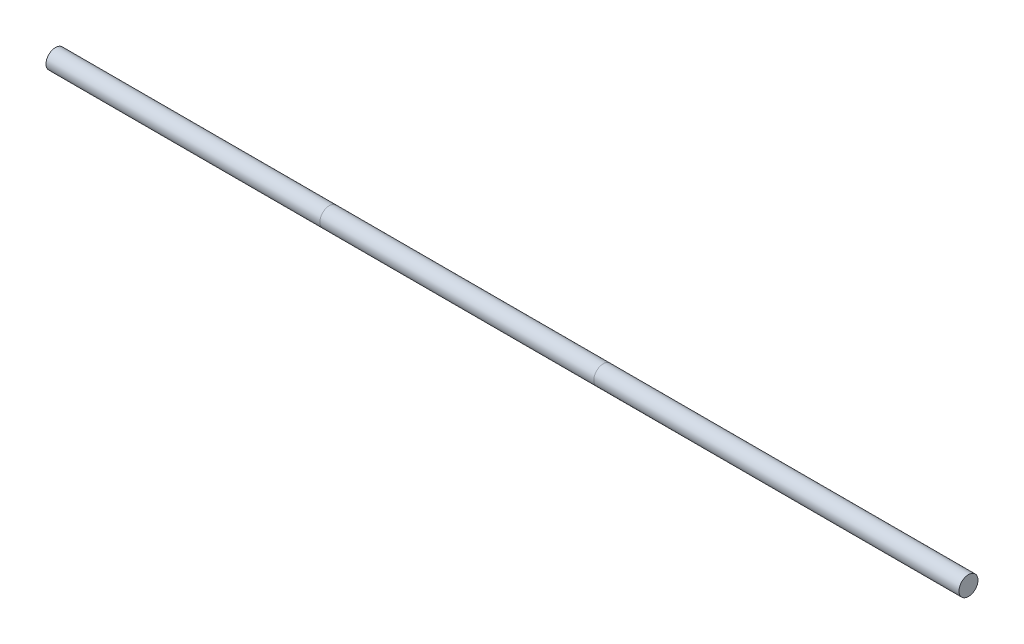
ISO-10303-21;
HEADER;
FILE_DESCRIPTION(('STEP AP214'),'2;1');
FILE_NAME('part.step','',(''),(''),'','','');
FILE_SCHEMA(('AUTOMOTIVE_DESIGN { 1 0 10303 214 1 1 1 1 }'));
ENDSEC;
DATA;
#1=APPLICATION_CONTEXT('core data for automotive mechanical design processes');
#2=APPLICATION_PROTOCOL_DEFINITION('international standard','automotive_design',2000,#1);
#3=PRODUCT_CONTEXT('',#1,'mechanical');
#4=PRODUCT('Part','Part','',(#3));
#5=PRODUCT_RELATED_PRODUCT_CATEGORY('part','',(#4));
#6=PRODUCT_DEFINITION_FORMATION('','',#4);
#7=PRODUCT_DEFINITION_CONTEXT('part definition',#1,'design');
#8=PRODUCT_DEFINITION('design','',#6,#7);
#9=PRODUCT_DEFINITION_SHAPE('','',#8);
#10=(LENGTH_UNIT() NAMED_UNIT(*) SI_UNIT(.MILLI.,.METRE.));
#11=(NAMED_UNIT(*) PLANE_ANGLE_UNIT() SI_UNIT($,.RADIAN.));
#12=(NAMED_UNIT(*) SI_UNIT($,.STERADIAN.) SOLID_ANGLE_UNIT());
#13=UNCERTAINTY_MEASURE_WITH_UNIT(LENGTH_MEASURE(1.E-05),#10,'distance_accuracy_value','');
#14=(GEOMETRIC_REPRESENTATION_CONTEXT(3) GLOBAL_UNCERTAINTY_ASSIGNED_CONTEXT((#13)) GLOBAL_UNIT_ASSIGNED_CONTEXT((#10,
#11,#12)) REPRESENTATION_CONTEXT('',''));
#15=CARTESIAN_POINT('',(0.,0.,0.));
#16=DIRECTION('',(0.,0.,1.));
#17=DIRECTION('',(1.,0.,0.));
#18=AXIS2_PLACEMENT_3D('',#15,#16,#17);
#19=CARTESIAN_POINT('',(3048.,0.,0.));
#20=DIRECTION('',(-1.,0.,0.));
#21=DIRECTION('',(0.,0.,1.));
#22=AXIS2_PLACEMENT_3D('',#19,#20,#21);
#23=CYLINDRICAL_SURFACE('',#22,31.75);
#24=CARTESIAN_POINT('',(3048.,0.,0.));
#25=DIRECTION('',(1.,0.,0.));
#26=DIRECTION('',(0.,0.,-1.));
#27=AXIS2_PLACEMENT_3D('',#24,#25,#26);
#28=CIRCLE('',#27,31.75);
#29=CARTESIAN_POINT('',(3048.,0.,-31.75));
#30=VERTEX_POINT('',#29);
#31=EDGE_CURVE('E11',#30,#30,#28,.T.);
#32=ORIENTED_EDGE('',*,*,#31,.F.);
#33=EDGE_LOOP('',(#32));
#34=FACE_BOUND('',#33,.T.);
#35=CARTESIAN_POINT('',(1828.8,0.,0.));
#36=DIRECTION('',(1.,0.,0.));
#37=DIRECTION('',(0.,0.,-1.));
#38=AXIS2_PLACEMENT_3D('',#35,#36,#37);
#39=CIRCLE('',#38,31.75);
#40=CARTESIAN_POINT('',(1828.8,0.,-31.75));
#41=VERTEX_POINT('',#40);
#42=EDGE_CURVE('E55',#41,#41,#39,.T.);
#43=ORIENTED_EDGE('',*,*,#42,.T.);
#44=EDGE_LOOP('',(#43));
#45=FACE_BOUND('',#44,.T.);
#46=ADVANCED_FACE('F52',(#34,#45),#23,.T.);
#47=CARTESIAN_POINT('',(3048.,0.,0.));
#48=DIRECTION('',(1.,0.,0.));
#49=DIRECTION('',(0.,0.,-1.));
#50=AXIS2_PLACEMENT_3D('',#47,#48,#49);
#51=PLANE('',#50);
#52=ORIENTED_EDGE('',*,*,#31,.T.);
#53=EDGE_LOOP('',(#52));
#54=FACE_BOUND('',#53,.T.);
#55=ADVANCED_FACE('F69',(#54),#51,.T.);
#56=CARTESIAN_POINT('',(1828.8,0.,0.));
#57=DIRECTION('',(1.,0.,0.));
#58=DIRECTION('',(0.,0.,-1.));
#59=AXIS2_PLACEMENT_3D('',#56,#57,#58);
#60=PLANE('',#59);
#61=ORIENTED_EDGE('',*,*,#42,.F.);
#62=EDGE_LOOP('',(#61));
#63=FACE_BOUND('',#62,.T.);
#64=ADVANCED_FACE('F67',(#63),#60,.F.);
#65=CLOSED_SHELL('',(#46,#55,#64));
#66=MANIFOLD_SOLID_BREP('B2',#65);
#67=CARTESIAN_POINT('',(1828.8,0.,0.));
#68=DIRECTION('',(-1.,0.,0.));
#69=DIRECTION('',(0.,0.,1.));
#70=AXIS2_PLACEMENT_3D('',#67,#68,#69);
#71=CYLINDRICAL_SURFACE('',#70,31.75);
#72=CARTESIAN_POINT('',(1828.8,0.,0.));
#73=DIRECTION('',(1.,0.,0.));
#74=DIRECTION('',(0.,0.,-1.));
#75=AXIS2_PLACEMENT_3D('',#72,#73,#74);
#76=CIRCLE('',#75,31.75);
#77=CARTESIAN_POINT('',(1828.8,0.,-31.75));
#78=VERTEX_POINT('',#77);
#79=EDGE_CURVE('E51',#78,#78,#76,.T.);
#80=ORIENTED_EDGE('',*,*,#79,.F.);
#81=EDGE_LOOP('',(#80));
#82=FACE_BOUND('',#81,.T.);
#83=CARTESIAN_POINT('',(914.4,0.,0.));
#84=DIRECTION('',(1.,0.,0.));
#85=DIRECTION('',(0.,0.,-1.));
#86=AXIS2_PLACEMENT_3D('',#83,#84,#85);
#87=CIRCLE('',#86,31.75);
#88=CARTESIAN_POINT('',(914.4,0.,-31.75));
#89=VERTEX_POINT('',#88);
#90=EDGE_CURVE('E107',#89,#89,#87,.T.);
#91=ORIENTED_EDGE('',*,*,#90,.T.);
#92=EDGE_LOOP('',(#91));
#93=FACE_BOUND('',#92,.T.);
#94=ADVANCED_FACE('F104',(#82,#93),#71,.T.);
#95=CARTESIAN_POINT('',(1828.8,0.,0.));
#96=DIRECTION('',(1.,0.,0.));
#97=DIRECTION('',(0.,0.,-1.));
#98=AXIS2_PLACEMENT_3D('',#95,#96,#97);
#99=PLANE('',#98);
#100=ORIENTED_EDGE('',*,*,#79,.T.);
#101=EDGE_LOOP('',(#100));
#102=FACE_BOUND('',#101,.T.);
#103=ADVANCED_FACE('F119',(#102),#99,.T.);
#104=CARTESIAN_POINT('',(914.4,0.,0.));
#105=DIRECTION('',(1.,0.,0.));
#106=DIRECTION('',(0.,0.,-1.));
#107=AXIS2_PLACEMENT_3D('',#104,#105,#106);
#108=PLANE('',#107);
#109=ORIENTED_EDGE('',*,*,#90,.F.);
#110=EDGE_LOOP('',(#109));
#111=FACE_BOUND('',#110,.T.);
#112=ADVANCED_FACE('F117',(#111),#108,.F.);
#113=CLOSED_SHELL('',(#94,#103,#112));
#114=MANIFOLD_SOLID_BREP('B6',#113);
#115=CARTESIAN_POINT('',(914.4,0.,0.));
#116=DIRECTION('',(-1.,0.,0.));
#117=DIRECTION('',(0.,0.,1.));
#118=AXIS2_PLACEMENT_3D('',#115,#116,#117);
#119=CYLINDRICAL_SURFACE('',#118,31.75);
#120=CARTESIAN_POINT('',(914.4,0.,0.));
#121=DIRECTION('',(1.,0.,0.));
#122=DIRECTION('',(0.,0.,-1.));
#123=AXIS2_PLACEMENT_3D('',#120,#121,#122);
#124=CIRCLE('',#123,31.75);
#125=CARTESIAN_POINT('',(914.4,0.,-31.75));
#126=VERTEX_POINT('',#125);
#127=EDGE_CURVE('E103',#126,#126,#124,.T.);
#128=ORIENTED_EDGE('',*,*,#127,.F.);
#129=EDGE_LOOP('',(#128));
#130=FACE_BOUND('',#129,.T.);
#131=CARTESIAN_POINT('',(0.,0.,0.));
#132=DIRECTION('',(1.,0.,0.));
#133=DIRECTION('',(0.,0.,-1.));
#134=AXIS2_PLACEMENT_3D('',#131,#132,#133);
#135=CIRCLE('',#134,31.75);
#136=CARTESIAN_POINT('',(0.,0.,-31.75));
#137=VERTEX_POINT('',#136);
#138=EDGE_CURVE('E150',#137,#137,#135,.T.);
#139=ORIENTED_EDGE('',*,*,#138,.T.);
#140=EDGE_LOOP('',(#139));
#141=FACE_BOUND('',#140,.T.);
#142=ADVANCED_FACE('F147',(#130,#141),#119,.T.);
#143=CARTESIAN_POINT('',(914.4,0.,0.));
#144=DIRECTION('',(1.,0.,0.));
#145=DIRECTION('',(0.,0.,-1.));
#146=AXIS2_PLACEMENT_3D('',#143,#144,#145);
#147=PLANE('',#146);
#148=ORIENTED_EDGE('',*,*,#127,.T.);
#149=EDGE_LOOP('',(#148));
#150=FACE_BOUND('',#149,.T.);
#151=ADVANCED_FACE('F162',(#150),#147,.T.);
#152=CARTESIAN_POINT('',(0.,0.,0.));
#153=DIRECTION('',(1.,0.,0.));
#154=DIRECTION('',(0.,0.,-1.));
#155=AXIS2_PLACEMENT_3D('',#152,#153,#154);
#156=PLANE('',#155);
#157=ORIENTED_EDGE('',*,*,#138,.F.);
#158=EDGE_LOOP('',(#157));
#159=FACE_BOUND('',#158,.T.);
#160=ADVANCED_FACE('F160',(#159),#156,.F.);
#161=CLOSED_SHELL('',(#142,#151,#160));
#162=MANIFOLD_SOLID_BREP('B46',#161);
#163=ADVANCED_BREP_SHAPE_REPRESENTATION('',(#18,#66,#114,#162),#14);
#164=SHAPE_DEFINITION_REPRESENTATION(#9,#163);
ENDSEC;
END-ISO-10303-21;
